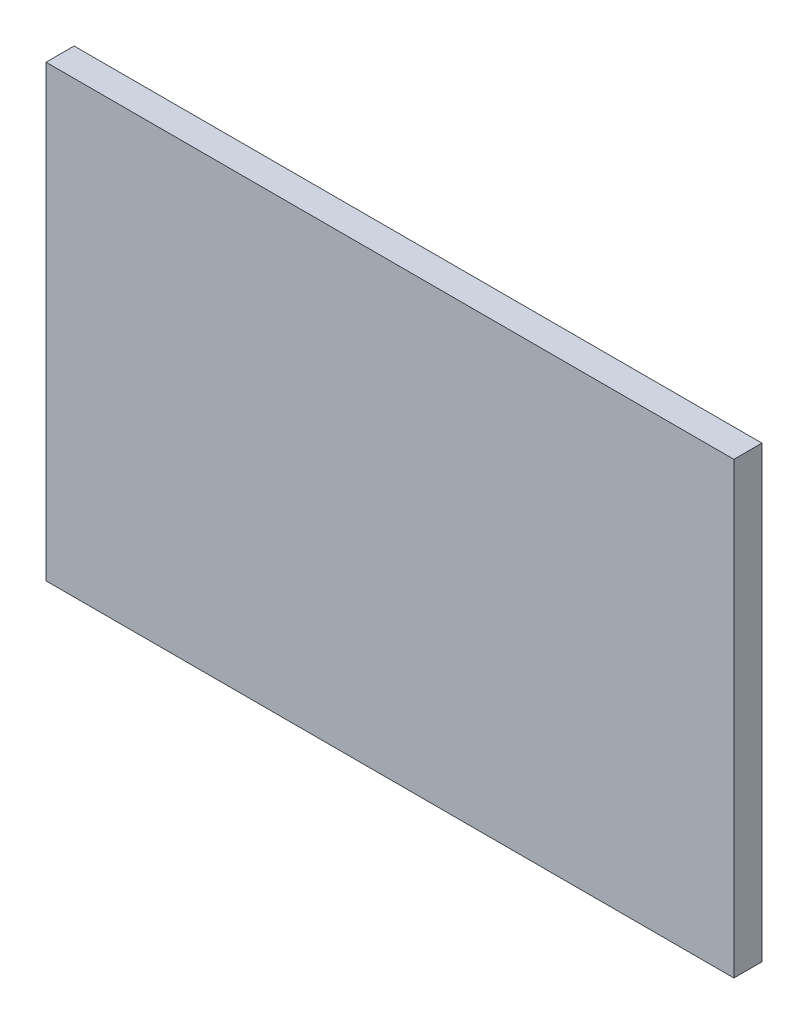
ISO-10303-21;
HEADER;
FILE_DESCRIPTION(('STEP AP214'),'2;1');
FILE_NAME('part.step','',(''),(''),'','','');
FILE_SCHEMA(('AUTOMOTIVE_DESIGN { 1 0 10303 214 1 1 1 1 }'));
ENDSEC;
DATA;
#1=APPLICATION_CONTEXT('core data for automotive mechanical design processes');
#2=APPLICATION_PROTOCOL_DEFINITION('international standard','automotive_design',2000,#1);
#3=PRODUCT_CONTEXT('',#1,'mechanical');
#4=PRODUCT('Part','Part','',(#3));
#5=PRODUCT_RELATED_PRODUCT_CATEGORY('part','',(#4));
#6=PRODUCT_DEFINITION_FORMATION('','',#4);
#7=PRODUCT_DEFINITION_CONTEXT('part definition',#1,'design');
#8=PRODUCT_DEFINITION('design','',#6,#7);
#9=PRODUCT_DEFINITION_SHAPE('','',#8);
#10=(LENGTH_UNIT() NAMED_UNIT(*) SI_UNIT(.MILLI.,.METRE.));
#11=(NAMED_UNIT(*) PLANE_ANGLE_UNIT() SI_UNIT($,.RADIAN.));
#12=(NAMED_UNIT(*) SI_UNIT($,.STERADIAN.) SOLID_ANGLE_UNIT());
#13=UNCERTAINTY_MEASURE_WITH_UNIT(LENGTH_MEASURE(1.E-05),#10,'distance_accuracy_value','');
#14=(GEOMETRIC_REPRESENTATION_CONTEXT(3) GLOBAL_UNCERTAINTY_ASSIGNED_CONTEXT((#13)) GLOBAL_UNIT_ASSIGNED_CONTEXT((#10,
#11,#12)) REPRESENTATION_CONTEXT('',''));
#15=CARTESIAN_POINT('',(0.,0.,0.));
#16=DIRECTION('',(0.,0.,1.));
#17=DIRECTION('',(1.,0.,0.));
#18=AXIS2_PLACEMENT_3D('',#15,#16,#17);
#19=CARTESIAN_POINT('',(-2.45000018,-1.59999934,0.2));
#20=DIRECTION('',(0.,0.,1.));
#21=DIRECTION('',(1.,0.,0.));
#22=AXIS2_PLACEMENT_3D('',#19,#20,#21);
#23=PLANE('',#22);
#24=DIRECTION('',(1.,0.,0.));
#25=VECTOR('',#24,1.);
#26=CARTESIAN_POINT('',(-2.45000018,1.60000188,0.2));
#27=LINE('',#26,#25);
#28=CARTESIAN_POINT('',(-2.45000018,1.60000188,0.2));
#29=VERTEX_POINT('',#28);
#30=CARTESIAN_POINT('',(2.45000018,1.60000188,0.2));
#31=VERTEX_POINT('',#30);
#32=EDGE_CURVE('E53',#29,#31,#27,.T.);
#33=ORIENTED_EDGE('',*,*,#32,.F.);
#34=DIRECTION('',(0.,1.,0.));
#35=VECTOR('',#34,1.);
#36=CARTESIAN_POINT('',(-2.45000018,-1.59999934,0.2));
#37=LINE('',#36,#35);
#38=CARTESIAN_POINT('',(-2.45000018,-1.59999934,0.2));
#39=VERTEX_POINT('',#38);
#40=EDGE_CURVE('E69',#39,#29,#37,.T.);
#41=ORIENTED_EDGE('',*,*,#40,.F.);
#42=DIRECTION('',(1.,0.,0.));
#43=VECTOR('',#42,1.);
#44=CARTESIAN_POINT('',(2.45000018,-1.59999934,0.2));
#45=LINE('',#44,#43);
#46=CARTESIAN_POINT('',(2.45000018,-1.59999934,0.2));
#47=VERTEX_POINT('',#46);
#48=EDGE_CURVE('E19',#47,#39,#45,.F.);
#49=ORIENTED_EDGE('',*,*,#48,.F.);
#50=DIRECTION('',(0.,1.,0.));
#51=VECTOR('',#50,1.);
#52=CARTESIAN_POINT('',(2.45000018,1.60000188,0.2));
#53=LINE('',#52,#51);
#54=EDGE_CURVE('E58',#31,#47,#53,.F.);
#55=ORIENTED_EDGE('',*,*,#54,.F.);
#56=EDGE_LOOP('',(#33,#41,#49,#55));
#57=FACE_BOUND('',#56,.T.);
#58=ADVANCED_FACE('F16',(#57),#23,.T.);
#59=CARTESIAN_POINT('',(2.45000018,-1.59999934,0.));
#60=DIRECTION('',(0.,-1.,0.));
#61=DIRECTION('',(0.,0.,-1.));
#62=AXIS2_PLACEMENT_3D('',#59,#60,#61);
#63=PLANE('',#62);
#64=DIRECTION('',(0.,0.,1.));
#65=VECTOR('',#64,1.);
#66=CARTESIAN_POINT('',(-2.45000018,-1.59999934,0.));
#67=LINE('',#66,#65);
#68=CARTESIAN_POINT('',(-2.45000018,-1.59999934,0.));
#69=VERTEX_POINT('',#68);
#70=EDGE_CURVE('E88',#69,#39,#67,.T.);
#71=ORIENTED_EDGE('',*,*,#70,.F.);
#72=DIRECTION('',(1.,0.,0.));
#73=VECTOR('',#72,1.);
#74=CARTESIAN_POINT('',(-2.45000018,-1.59999934,0.));
#75=LINE('',#74,#73);
#76=CARTESIAN_POINT('',(2.45000018,-1.59999934,0.));
#77=VERTEX_POINT('',#76);
#78=EDGE_CURVE('E76',#69,#77,#75,.T.);
#79=ORIENTED_EDGE('',*,*,#78,.T.);
#80=DIRECTION('',(0.,0.,-1.));
#81=VECTOR('',#80,1.);
#82=CARTESIAN_POINT('',(2.45000018,-1.59999934,0.));
#83=LINE('',#82,#81);
#84=EDGE_CURVE('E63',#47,#77,#83,.T.);
#85=ORIENTED_EDGE('',*,*,#84,.F.);
#86=ORIENTED_EDGE('',*,*,#48,.T.);
#87=EDGE_LOOP('',(#71,#79,#85,#86));
#88=FACE_BOUND('',#87,.T.);
#89=ADVANCED_FACE('F75',(#88),#63,.T.);
#90=CARTESIAN_POINT('',(2.45000018,1.60000188,0.));
#91=DIRECTION('',(1.,0.,0.));
#92=DIRECTION('',(0.,0.,-1.));
#93=AXIS2_PLACEMENT_3D('',#90,#91,#92);
#94=PLANE('',#93);
#95=ORIENTED_EDGE('',*,*,#84,.T.);
#96=DIRECTION('',(0.,1.,0.));
#97=VECTOR('',#96,1.);
#98=CARTESIAN_POINT('',(2.45000018,-1.59999934,0.));
#99=LINE('',#98,#97);
#100=CARTESIAN_POINT('',(2.45000018,1.60000188,0.));
#101=VERTEX_POINT('',#100);
#102=EDGE_CURVE('E96',#77,#101,#99,.T.);
#103=ORIENTED_EDGE('',*,*,#102,.T.);
#104=DIRECTION('',(0.,0.,1.));
#105=VECTOR('',#104,1.);
#106=CARTESIAN_POINT('',(2.45000018,1.60000188,0.));
#107=LINE('',#106,#105);
#108=EDGE_CURVE('E65',#31,#101,#107,.F.);
#109=ORIENTED_EDGE('',*,*,#108,.F.);
#110=ORIENTED_EDGE('',*,*,#54,.T.);
#111=EDGE_LOOP('',(#95,#103,#109,#110));
#112=FACE_BOUND('',#111,.T.);
#113=ADVANCED_FACE('F60',(#112),#94,.T.);
#114=CARTESIAN_POINT('',(-2.45000018,1.60000188,0.));
#115=DIRECTION('',(0.,1.,0.));
#116=DIRECTION('',(0.,0.,1.));
#117=AXIS2_PLACEMENT_3D('',#114,#115,#116);
#118=PLANE('',#117);
#119=ORIENTED_EDGE('',*,*,#108,.T.);
#120=DIRECTION('',(1.,0.,0.));
#121=VECTOR('',#120,1.);
#122=CARTESIAN_POINT('',(-2.45000018,1.60000188,0.));
#123=LINE('',#122,#121);
#124=CARTESIAN_POINT('',(-2.45000018,1.60000188,0.));
#125=VERTEX_POINT('',#124);
#126=EDGE_CURVE('E26',#101,#125,#123,.F.);
#127=ORIENTED_EDGE('',*,*,#126,.T.);
#128=DIRECTION('',(0.,0.,1.));
#129=VECTOR('',#128,1.);
#130=CARTESIAN_POINT('',(-2.45000018,1.60000188,0.));
#131=LINE('',#130,#129);
#132=EDGE_CURVE('E34',#29,#125,#131,.F.);
#133=ORIENTED_EDGE('',*,*,#132,.F.);
#134=ORIENTED_EDGE('',*,*,#32,.T.);
#135=EDGE_LOOP('',(#119,#127,#133,#134));
#136=FACE_BOUND('',#135,.T.);
#137=ADVANCED_FACE('F102',(#136),#118,.T.);
#138=CARTESIAN_POINT('',(-2.45000018,-1.59999934,0.));
#139=DIRECTION('',(-1.,0.,0.));
#140=DIRECTION('',(0.,0.,1.));
#141=AXIS2_PLACEMENT_3D('',#138,#139,#140);
#142=PLANE('',#141);
#143=ORIENTED_EDGE('',*,*,#132,.T.);
#144=DIRECTION('',(0.,1.,0.));
#145=VECTOR('',#144,1.);
#146=CARTESIAN_POINT('',(-2.45000018,-1.59999934,0.));
#147=LINE('',#146,#145);
#148=EDGE_CURVE('E11',#125,#69,#147,.F.);
#149=ORIENTED_EDGE('',*,*,#148,.T.);
#150=ORIENTED_EDGE('',*,*,#70,.T.);
#151=ORIENTED_EDGE('',*,*,#40,.T.);
#152=EDGE_LOOP('',(#143,#149,#150,#151));
#153=FACE_BOUND('',#152,.T.);
#154=ADVANCED_FACE('F105',(#153),#142,.T.);
#155=CARTESIAN_POINT('',(-2.45000018,-1.59999934,0.));
#156=DIRECTION('',(0.,0.,1.));
#157=DIRECTION('',(1.,0.,0.));
#158=AXIS2_PLACEMENT_3D('',#155,#156,#157);
#159=PLANE('',#158);
#160=ORIENTED_EDGE('',*,*,#126,.F.);
#161=ORIENTED_EDGE('',*,*,#102,.F.);
#162=ORIENTED_EDGE('',*,*,#78,.F.);
#163=ORIENTED_EDGE('',*,*,#148,.F.);
#164=EDGE_LOOP('',(#160,#161,#162,#163));
#165=FACE_BOUND('',#164,.T.);
#166=ADVANCED_FACE('F104',(#165),#159,.F.);
#167=CLOSED_SHELL('',(#58,#89,#113,#137,#154,#166));
#168=MANIFOLD_SOLID_BREP('B1',#167);
#169=ADVANCED_BREP_SHAPE_REPRESENTATION('',(#18,#168),#14);
#170=SHAPE_DEFINITION_REPRESENTATION(#9,#169);
ENDSEC;
END-ISO-10303-21;
